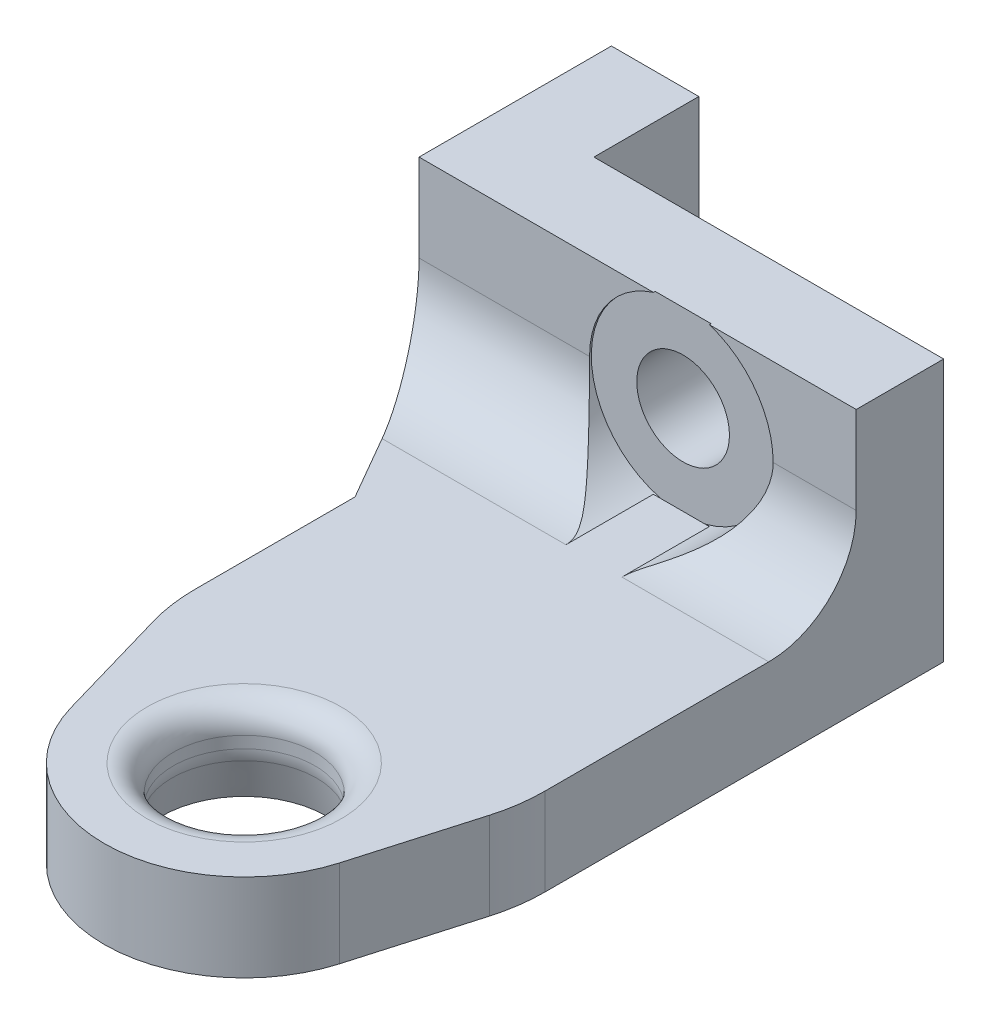
ISO-10303-21;
HEADER;
FILE_DESCRIPTION(('STEP AP214'),'2;1');
FILE_NAME('part.step','',(''),(''),'','','');
FILE_SCHEMA(('AUTOMOTIVE_DESIGN { 1 0 10303 214 1 1 1 1 }'));
ENDSEC;
DATA;
#1=APPLICATION_CONTEXT('core data for automotive mechanical design processes');
#2=APPLICATION_PROTOCOL_DEFINITION('international standard','automotive_design',2000,#1);
#3=PRODUCT_CONTEXT('',#1,'mechanical');
#4=PRODUCT('Part','Part','',(#3));
#5=PRODUCT_RELATED_PRODUCT_CATEGORY('part','',(#4));
#6=PRODUCT_DEFINITION_FORMATION('','',#4);
#7=PRODUCT_DEFINITION_CONTEXT('part definition',#1,'design');
#8=PRODUCT_DEFINITION('design','',#6,#7);
#9=PRODUCT_DEFINITION_SHAPE('','',#8);
#10=(LENGTH_UNIT() NAMED_UNIT(*) SI_UNIT(.MILLI.,.METRE.));
#11=(NAMED_UNIT(*) PLANE_ANGLE_UNIT() SI_UNIT($,.RADIAN.));
#12=(NAMED_UNIT(*) SI_UNIT($,.STERADIAN.) SOLID_ANGLE_UNIT());
#13=UNCERTAINTY_MEASURE_WITH_UNIT(LENGTH_MEASURE(1.E-05),#10,'distance_accuracy_value','');
#14=(GEOMETRIC_REPRESENTATION_CONTEXT(3) GLOBAL_UNCERTAINTY_ASSIGNED_CONTEXT((#13)) GLOBAL_UNIT_ASSIGNED_CONTEXT((#10,
#11,#12)) REPRESENTATION_CONTEXT('',''));
#15=CARTESIAN_POINT('',(0.,0.,0.));
#16=DIRECTION('',(0.,0.,1.));
#17=DIRECTION('',(1.,0.,0.));
#18=AXIS2_PLACEMENT_3D('',#15,#16,#17);
#19=CARTESIAN_POINT('',(10.,15.,-25.));
#20=DIRECTION('',(0.,0.,-1.));
#21=DIRECTION('',(-1.,0.,0.));
#22=AXIS2_PLACEMENT_3D('',#19,#20,#21);
#23=PLANE('',#22);
#24=DIRECTION('',(0.,-1.,0.));
#25=VECTOR('',#24,1.);
#26=CARTESIAN_POINT('',(-15.,15.,-25.));
#27=LINE('',#26,#25);
#28=CARTESIAN_POINT('',(-15.,15.,-25.));
#29=VERTEX_POINT('',#28);
#30=CARTESIAN_POINT('',(-15.,10.,-25.));
#31=VERTEX_POINT('',#30);
#32=EDGE_CURVE('E393',#29,#31,#27,.T.);
#33=ORIENTED_EDGE('',*,*,#32,.T.);
#34=DIRECTION('',(1.,0.,0.));
#35=VECTOR('',#34,1.);
#36=CARTESIAN_POINT('',(10.,10.,-25.));
#37=LINE('',#36,#35);
#38=CARTESIAN_POINT('',(-5.25,10.,-25.));
#39=VERTEX_POINT('',#38);
#40=EDGE_CURVE('E216',#31,#39,#37,.T.);
#41=ORIENTED_EDGE('',*,*,#40,.T.);
#42=CARTESIAN_POINT('',(0.,10.,-25.));
#43=DIRECTION('',(0.,0.,1.));
#44=DIRECTION('',(1.,0.,0.));
#45=AXIS2_PLACEMENT_3D('',#42,#43,#44);
#46=CIRCLE('',#45,5.25);
#47=CARTESIAN_POINT('',(-1.60078105935822,15.,-25.));
#48=VERTEX_POINT('',#47);
#49=EDGE_CURVE('E182',#48,#39,#46,.T.);
#50=ORIENTED_EDGE('',*,*,#49,.F.);
#51=DIRECTION('',(1.,0.,0.));
#52=VECTOR('',#51,1.);
#53=CARTESIAN_POINT('',(10.,15.,-25.));
#54=LINE('',#53,#52);
#55=EDGE_CURVE('E386',#29,#48,#54,.T.);
#56=ORIENTED_EDGE('',*,*,#55,.F.);
#57=EDGE_LOOP('',(#33,#41,#50,#56));
#58=FACE_BOUND('',#57,.T.);
#59=ADVANCED_FACE('F32',(#58),#23,.F.);
#60=CARTESIAN_POINT('',(5.25,10.,-25.));
#61=VERTEX_POINT('',#60);
#62=CARTESIAN_POINT('',(1.60078105935822,15.,-25.));
#63=VERTEX_POINT('',#62);
#64=EDGE_CURVE('E171',#61,#63,#46,.T.);
#65=ORIENTED_EDGE('',*,*,#64,.F.);
#66=DIRECTION('',(1.,0.,0.));
#67=VECTOR('',#66,1.);
#68=CARTESIAN_POINT('',(10.,10.,-25.));
#69=LINE('',#68,#67);
#70=CARTESIAN_POINT('',(10.,10.,-25.));
#71=VERTEX_POINT('',#70);
#72=EDGE_CURVE('E203',#61,#71,#69,.T.);
#73=ORIENTED_EDGE('',*,*,#72,.T.);
#74=DIRECTION('',(0.,-1.,0.));
#75=VECTOR('',#74,1.);
#76=CARTESIAN_POINT('',(10.,15.,-25.));
#77=LINE('',#76,#75);
#78=CARTESIAN_POINT('',(10.,15.,-25.));
#79=VERTEX_POINT('',#78);
#80=EDGE_CURVE('E388',#79,#71,#77,.T.);
#81=ORIENTED_EDGE('',*,*,#80,.F.);
#82=EDGE_CURVE('E385',#63,#79,#54,.T.);
#83=ORIENTED_EDGE('',*,*,#82,.F.);
#84=EDGE_LOOP('',(#65,#73,#81,#83));
#85=FACE_BOUND('',#84,.T.);
#86=ADVANCED_FACE('F259',(#85),#23,.F.);
#87=CARTESIAN_POINT('',(7.68461887368189,0.,2.22410268788388));
#88=DIRECTION('',(0.960577359210234,0.,0.278012835985485));
#89=DIRECTION('',(0.278012835985485,0.,-0.960577359210234));
#90=AXIS2_PLACEMENT_3D('',#87,#88,#89);
#91=PLANE('',#90);
#92=DIRECTION('',(0.278012835985485,0.,-0.960577359210234));
#93=VECTOR('',#92,1.);
#94=CARTESIAN_POINT('',(7.68461887368189,0.,2.22410268788388));
#95=LINE('',#94,#93);
#96=CARTESIAN_POINT('',(7.68461887368189,0.,2.22410268788387));
#97=VERTEX_POINT('',#96);
#98=CARTESIAN_POINT('',(9.60577359210235,0.,-4.41378408275055));
#99=VERTEX_POINT('',#98);
#100=EDGE_CURVE('E396',#97,#99,#95,.T.);
#101=ORIENTED_EDGE('',*,*,#100,.T.);
#102=DIRECTION('',(0.,1.,0.));
#103=VECTOR('',#102,1.);
#104=CARTESIAN_POINT('',(9.60577359210235,0.,-4.41378408275055));
#105=LINE('',#104,#103);
#106=CARTESIAN_POINT('',(9.60577359210235,5.,-4.41378408275055));
#107=VERTEX_POINT('',#106);
#108=EDGE_CURVE('E475',#99,#107,#105,.T.);
#109=ORIENTED_EDGE('',*,*,#108,.T.);
#110=DIRECTION('',(0.278012835985485,0.,-0.960577359210234));
#111=VECTOR('',#110,1.);
#112=CARTESIAN_POINT('',(7.68461887368189,5.,2.22410268788388));
#113=LINE('',#112,#111);
#114=CARTESIAN_POINT('',(7.68461887368189,5.,2.22410268788387));
#115=VERTEX_POINT('',#114);
#116=EDGE_CURVE('E395',#115,#107,#113,.T.);
#117=ORIENTED_EDGE('',*,*,#116,.F.);
#118=DIRECTION('',(0.,1.,0.));
#119=VECTOR('',#118,1.);
#120=CARTESIAN_POINT('',(7.68461887368189,0.,2.22410268788387));
#121=LINE('',#120,#119);
#122=EDGE_CURVE('E188',#97,#115,#121,.T.);
#123=ORIENTED_EDGE('',*,*,#122,.F.);
#124=EDGE_LOOP('',(#101,#109,#117,#123));
#125=FACE_BOUND('',#124,.T.);
#126=ADVANCED_FACE('F265',(#125),#91,.T.);
#127=CARTESIAN_POINT('',(0.,0.,0.));
#128=DIRECTION('',(0.,1.,0.));
#129=DIRECTION('',(0.,0.,1.));
#130=AXIS2_PLACEMENT_3D('',#127,#128,#129);
#131=CYLINDRICAL_SURFACE('',#130,8.00000000000001);
#132=CARTESIAN_POINT('',(0.,5.,0.));
#133=DIRECTION('',(0.,1.,0.));
#134=DIRECTION('',(0.,0.,1.));
#135=AXIS2_PLACEMENT_3D('',#132,#133,#134);
#136=CIRCLE('',#135,8.00000000000001);
#137=CARTESIAN_POINT('',(-7.68461887368188,5.,2.22410268788388));
#138=VERTEX_POINT('',#137);
#139=EDGE_CURVE('E400',#138,#115,#136,.T.);
#140=ORIENTED_EDGE('',*,*,#139,.F.);
#141=DIRECTION('',(0.,1.,0.));
#142=VECTOR('',#141,1.);
#143=CARTESIAN_POINT('',(-7.68461887368188,0.,2.22410268788388));
#144=LINE('',#143,#142);
#145=CARTESIAN_POINT('',(-7.68461887368188,0.,2.22410268788388));
#146=VERTEX_POINT('',#145);
#147=EDGE_CURVE('E431',#146,#138,#144,.T.);
#148=ORIENTED_EDGE('',*,*,#147,.F.);
#149=CARTESIAN_POINT('',(0.,0.,0.));
#150=DIRECTION('',(0.,1.,0.));
#151=DIRECTION('',(0.,0.,1.));
#152=AXIS2_PLACEMENT_3D('',#149,#150,#151);
#153=CIRCLE('',#152,8.00000000000001);
#154=EDGE_CURVE('E413',#146,#97,#153,.T.);
#155=ORIENTED_EDGE('',*,*,#154,.T.);
#156=ORIENTED_EDGE('',*,*,#122,.T.);
#157=EDGE_LOOP('',(#140,#148,#155,#156));
#158=FACE_BOUND('',#157,.T.);
#159=ADVANCED_FACE('F280',(#158),#131,.T.);
#160=CARTESIAN_POINT('',(-10.,0.,-5.77589731211611));
#161=DIRECTION('',(-0.960577359210234,0.,0.278012835985485));
#162=DIRECTION('',(0.278012835985486,0.,0.960577359210234));
#163=AXIS2_PLACEMENT_3D('',#160,#161,#162);
#164=PLANE('',#163);
#165=DIRECTION('',(0.278012835985486,0.,0.960577359210234));
#166=VECTOR('',#165,1.);
#167=CARTESIAN_POINT('',(-10.,5.,-5.77589731211611));
#168=LINE('',#167,#166);
#169=CARTESIAN_POINT('',(-9.60577359210235,5.,-4.41378408275054));
#170=VERTEX_POINT('',#169);
#171=EDGE_CURVE('E426',#170,#138,#168,.T.);
#172=ORIENTED_EDGE('',*,*,#171,.F.);
#173=DIRECTION('',(0.,1.,0.));
#174=VECTOR('',#173,1.);
#175=CARTESIAN_POINT('',(-9.60577359210235,0.,-4.41378408275055));
#176=LINE('',#175,#174);
#177=CARTESIAN_POINT('',(-9.60577359210235,0.,-4.41378408275054));
#178=VERTEX_POINT('',#177);
#179=EDGE_CURVE('E11',#170,#178,#176,.F.);
#180=ORIENTED_EDGE('',*,*,#179,.T.);
#181=DIRECTION('',(0.278012835985486,0.,0.960577359210234));
#182=VECTOR('',#181,1.);
#183=CARTESIAN_POINT('',(-10.,0.,-5.77589731211611));
#184=LINE('',#183,#182);
#185=EDGE_CURVE('E411',#178,#146,#184,.T.);
#186=ORIENTED_EDGE('',*,*,#185,.T.);
#187=ORIENTED_EDGE('',*,*,#147,.T.);
#188=EDGE_LOOP('',(#172,#180,#186,#187));
#189=FACE_BOUND('',#188,.T.);
#190=ADVANCED_FACE('F283',(#189),#164,.T.);
#191=CARTESIAN_POINT('',(-10.,0.,-16.3397459621555));
#192=DIRECTION('',(-1.,0.,0.));
#193=DIRECTION('',(0.,0.,1.));
#194=AXIS2_PLACEMENT_3D('',#191,#192,#193);
#195=PLANE('',#194);
#196=DIRECTION('',(0.,0.,1.));
#197=VECTOR('',#196,1.);
#198=CARTESIAN_POINT('',(-10.,0.,-16.3397459621555));
#199=LINE('',#198,#197);
#200=CARTESIAN_POINT('',(-10.,0.,-16.3397459621555));
#201=VERTEX_POINT('',#200);
#202=CARTESIAN_POINT('',(-10.,0.,-7.1939124426054));
#203=VERTEX_POINT('',#202);
#204=EDGE_CURVE('E409',#201,#203,#199,.T.);
#205=ORIENTED_EDGE('',*,*,#204,.T.);
#206=DIRECTION('',(0.,1.,0.));
#207=VECTOR('',#206,1.);
#208=CARTESIAN_POINT('',(-10.,0.,-7.1939124426054));
#209=LINE('',#208,#207);
#210=CARTESIAN_POINT('',(-10.,5.,-7.1939124426054));
#211=VERTEX_POINT('',#210);
#212=EDGE_CURVE('E40',#203,#211,#209,.T.);
#213=ORIENTED_EDGE('',*,*,#212,.T.);
#214=DIRECTION('',(0.,0.,1.));
#215=VECTOR('',#214,1.);
#216=CARTESIAN_POINT('',(-10.,5.,-16.3397459621555));
#217=LINE('',#216,#215);
#218=CARTESIAN_POINT('',(-10.,5.,-16.3397459621555));
#219=VERTEX_POINT('',#218);
#220=EDGE_CURVE('E423',#219,#211,#217,.T.);
#221=ORIENTED_EDGE('',*,*,#220,.F.);
#222=DIRECTION('',(0.,1.,0.));
#223=VECTOR('',#222,1.);
#224=CARTESIAN_POINT('',(-10.,0.,-16.3397459621555));
#225=LINE('',#224,#223);
#226=EDGE_CURVE('E434',#201,#219,#225,.T.);
#227=ORIENTED_EDGE('',*,*,#226,.F.);
#228=EDGE_LOOP('',(#205,#213,#221,#227));
#229=FACE_BOUND('',#228,.T.);
#230=ADVANCED_FACE('F287',(#229),#195,.T.);
#231=CARTESIAN_POINT('',(-15.,0.,-25.));
#232=DIRECTION('',(-0.866025403784441,0.,0.499999999999996));
#233=DIRECTION('',(0.499999999999996,0.,0.866025403784441));
#234=AXIS2_PLACEMENT_3D('',#231,#232,#233);
#235=PLANE('',#234);
#236=DIRECTION('',(0.499999999999996,0.,0.866025403784441));
#237=VECTOR('',#236,1.);
#238=CARTESIAN_POINT('',(-15.,5.,-25.));
#239=LINE('',#238,#237);
#240=CARTESIAN_POINT('',(-12.1132486540519,5.,-20.));
#241=VERTEX_POINT('',#240);
#242=EDGE_CURVE('E421',#241,#219,#239,.T.);
#243=ORIENTED_EDGE('',*,*,#242,.F.);
#244=CARTESIAN_POINT('',(-12.1132486540519,10.,-20.));
#245=DIRECTION('',(-0.866025403784441,0.,0.499999999999996));
#246=DIRECTION('',(0.499999999999996,0.,0.866025403784441));
#247=AXIS2_PLACEMENT_3D('',#244,#245,#246);
#248=ELLIPSE('',#247,5.77350269189624,5.);
#249=EDGE_CURVE('E485',#241,#31,#248,.F.);
#250=ORIENTED_EDGE('',*,*,#249,.T.);
#251=DIRECTION('',(0.,1.,0.));
#252=VECTOR('',#251,1.);
#253=CARTESIAN_POINT('',(-15.,0.,-25.));
#254=LINE('',#253,#252);
#255=CARTESIAN_POINT('',(-15.,0.,-25.));
#256=VERTEX_POINT('',#255);
#257=EDGE_CURVE('E437',#256,#31,#254,.T.);
#258=ORIENTED_EDGE('',*,*,#257,.F.);
#259=DIRECTION('',(0.499999999999996,0.,0.866025403784441));
#260=VECTOR('',#259,1.);
#261=CARTESIAN_POINT('',(-15.,0.,-25.));
#262=LINE('',#261,#260);
#263=EDGE_CURVE('E406',#256,#201,#262,.T.);
#264=ORIENTED_EDGE('',*,*,#263,.T.);
#265=ORIENTED_EDGE('',*,*,#226,.T.);
#266=EDGE_LOOP('',(#243,#250,#258,#264,#265));
#267=FACE_BOUND('',#266,.T.);
#268=ADVANCED_FACE('F290',(#267),#235,.T.);
#269=CARTESIAN_POINT('',(-15.,0.,-36.));
#270=DIRECTION('',(-1.,0.,0.));
#271=DIRECTION('',(0.,0.,1.));
#272=AXIS2_PLACEMENT_3D('',#269,#270,#271);
#273=PLANE('',#272);
#274=ORIENTED_EDGE('',*,*,#257,.T.);
#275=ORIENTED_EDGE('',*,*,#32,.F.);
#276=DIRECTION('',(0.,0.,1.));
#277=VECTOR('',#276,1.);
#278=CARTESIAN_POINT('',(-15.,15.,-25.));
#279=LINE('',#278,#277);
#280=CARTESIAN_POINT('',(-15.,15.,-36.));
#281=VERTEX_POINT('',#280);
#282=EDGE_CURVE('E383',#281,#29,#279,.T.);
#283=ORIENTED_EDGE('',*,*,#282,.F.);
#284=DIRECTION('',(0.,1.,0.));
#285=VECTOR('',#284,1.);
#286=CARTESIAN_POINT('',(-15.,0.,-36.));
#287=LINE('',#286,#285);
#288=CARTESIAN_POINT('',(-15.,0.,-36.));
#289=VERTEX_POINT('',#288);
#290=EDGE_CURVE('E416',#289,#281,#287,.T.);
#291=ORIENTED_EDGE('',*,*,#290,.F.);
#292=DIRECTION('',(0.,0.,1.));
#293=VECTOR('',#292,1.);
#294=CARTESIAN_POINT('',(-15.,0.,-36.));
#295=LINE('',#294,#293);
#296=EDGE_CURVE('E403',#289,#256,#295,.T.);
#297=ORIENTED_EDGE('',*,*,#296,.T.);
#298=EDGE_LOOP('',(#274,#275,#283,#291,#297));
#299=FACE_BOUND('',#298,.T.);
#300=ADVANCED_FACE('F294',(#299),#273,.T.);
#301=CARTESIAN_POINT('',(9.99999999999999,0.,-36.));
#302=DIRECTION('',(0.,0.,-1.));
#303=DIRECTION('',(-1.,0.,0.));
#304=AXIS2_PLACEMENT_3D('',#301,#302,#303);
#305=PLANE('',#304);
#306=DIRECTION('',(0.,-1.,0.));
#307=VECTOR('',#306,1.);
#308=CARTESIAN_POINT('',(-10.,15.,-36.));
#309=LINE('',#308,#307);
#310=CARTESIAN_POINT('',(-10.,15.,-36.));
#311=VERTEX_POINT('',#310);
#312=CARTESIAN_POINT('',(-10.,0.,-36.));
#313=VERTEX_POINT('',#312);
#314=EDGE_CURVE('E375',#311,#313,#309,.T.);
#315=ORIENTED_EDGE('',*,*,#314,.T.);
#316=DIRECTION('',(-1.,0.,0.));
#317=VECTOR('',#316,1.);
#318=CARTESIAN_POINT('',(9.99999999999999,0.,-36.));
#319=LINE('',#318,#317);
#320=EDGE_CURVE('E364',#313,#289,#319,.T.);
#321=ORIENTED_EDGE('',*,*,#320,.T.);
#322=ORIENTED_EDGE('',*,*,#290,.T.);
#323=DIRECTION('',(-1.,0.,0.));
#324=VECTOR('',#323,1.);
#325=CARTESIAN_POINT('',(-15.,15.,-36.));
#326=LINE('',#325,#324);
#327=EDGE_CURVE('E381',#311,#281,#326,.T.);
#328=ORIENTED_EDGE('',*,*,#327,.F.);
#329=EDGE_LOOP('',(#315,#321,#322,#328));
#330=FACE_BOUND('',#329,.T.);
#331=ADVANCED_FACE('F298',(#330),#305,.T.);
#332=CARTESIAN_POINT('',(10.,0.,-5.77589731211612));
#333=DIRECTION('',(1.,0.,0.));
#334=DIRECTION('',(0.,0.,-1.));
#335=AXIS2_PLACEMENT_3D('',#332,#333,#334);
#336=PLANE('',#335);
#337=DIRECTION('',(0.,0.,-1.));
#338=VECTOR('',#337,1.);
#339=CARTESIAN_POINT('',(10.,5.,-5.77589731211612));
#340=LINE('',#339,#338);
#341=CARTESIAN_POINT('',(10.,5.,-7.19391244260541));
#342=VERTEX_POINT('',#341);
#343=CARTESIAN_POINT('',(10.,5.,-20.));
#344=VERTEX_POINT('',#343);
#345=EDGE_CURVE('E419',#342,#344,#340,.T.);
#346=ORIENTED_EDGE('',*,*,#345,.F.);
#347=DIRECTION('',(0.,1.,0.));
#348=VECTOR('',#347,1.);
#349=CARTESIAN_POINT('',(10.,0.,-7.19391244260541));
#350=LINE('',#349,#348);
#351=CARTESIAN_POINT('',(10.,0.,-7.19391244260541));
#352=VERTEX_POINT('',#351);
#353=EDGE_CURVE('E470',#342,#352,#350,.F.);
#354=ORIENTED_EDGE('',*,*,#353,.T.);
#355=DIRECTION('',(0.,0.,-1.));
#356=VECTOR('',#355,1.);
#357=CARTESIAN_POINT('',(10.,0.,-5.77589731211612));
#358=LINE('',#357,#356);
#359=CARTESIAN_POINT('',(9.99999999999999,0.,-30.));
#360=VERTEX_POINT('',#359);
#361=EDGE_CURVE('E399',#352,#360,#358,.T.);
#362=ORIENTED_EDGE('',*,*,#361,.T.);
#363=DIRECTION('',(0.,-1.,0.));
#364=VECTOR('',#363,1.);
#365=CARTESIAN_POINT('',(9.99999999999999,15.,-30.));
#366=LINE('',#365,#364);
#367=CARTESIAN_POINT('',(9.99999999999999,15.,-30.));
#368=VERTEX_POINT('',#367);
#369=EDGE_CURVE('E357',#368,#360,#366,.T.);
#370=ORIENTED_EDGE('',*,*,#369,.F.);
#371=DIRECTION('',(0.,0.,-1.));
#372=VECTOR('',#371,1.);
#373=CARTESIAN_POINT('',(9.99999999999999,15.,-36.));
#374=LINE('',#373,#372);
#375=EDGE_CURVE('E378',#79,#368,#374,.T.);
#376=ORIENTED_EDGE('',*,*,#375,.F.);
#377=ORIENTED_EDGE('',*,*,#80,.T.);
#378=CARTESIAN_POINT('',(10.,10.,-20.));
#379=DIRECTION('',(1.,0.,0.));
#380=DIRECTION('',(0.,0.,-1.));
#381=AXIS2_PLACEMENT_3D('',#378,#379,#380);
#382=CIRCLE('',#381,5.);
#383=EDGE_CURVE('E219',#71,#344,#382,.F.);
#384=ORIENTED_EDGE('',*,*,#383,.T.);
#385=EDGE_LOOP('',(#346,#354,#362,#370,#376,#377,#384));
#386=FACE_BOUND('',#385,.T.);
#387=ADVANCED_FACE('F275',(#386),#336,.T.);
#388=CARTESIAN_POINT('',(0.,0.,0.));
#389=DIRECTION('',(0.,1.,0.));
#390=DIRECTION('',(0.,0.,1.));
#391=AXIS2_PLACEMENT_3D('',#388,#389,#390);
#392=PLANE('',#391);
#393=CARTESIAN_POINT('',(0.,0.,0.));
#394=DIRECTION('',(0.,-1.,0.));
#395=DIRECTION('',(0.,0.,-1.));
#396=AXIS2_PLACEMENT_3D('',#393,#394,#395);
#397=CIRCLE('',#396,4.71987298107022);
#398=CARTESIAN_POINT('',(0.,0.,-4.71987298107024));
#399=VERTEX_POINT('',#398);
#400=EDGE_CURVE('E360',#399,#399,#397,.T.);
#401=ORIENTED_EDGE('',*,*,#400,.F.);
#402=EDGE_LOOP('',(#401));
#403=FACE_BOUND('',#402,.T.);
#404=ORIENTED_EDGE('',*,*,#361,.F.);
#405=CARTESIAN_POINT('',(0.,0.,-7.1939124426054));
#406=DIRECTION('',(0.,1.,0.));
#407=DIRECTION('',(0.,0.,1.));
#408=AXIS2_PLACEMENT_3D('',#405,#406,#407);
#409=CIRCLE('',#408,10.);
#410=EDGE_CURVE('E472',#352,#99,#409,.F.);
#411=ORIENTED_EDGE('',*,*,#410,.T.);
#412=ORIENTED_EDGE('',*,*,#100,.F.);
#413=ORIENTED_EDGE('',*,*,#154,.F.);
#414=ORIENTED_EDGE('',*,*,#185,.F.);
#415=CARTESIAN_POINT('',(0.,0.,-7.1939124426054));
#416=DIRECTION('',(0.,1.,0.));
#417=DIRECTION('',(0.,0.,1.));
#418=AXIS2_PLACEMENT_3D('',#415,#416,#417);
#419=CIRCLE('',#418,10.);
#420=EDGE_CURVE('E47',#178,#203,#419,.F.);
#421=ORIENTED_EDGE('',*,*,#420,.T.);
#422=ORIENTED_EDGE('',*,*,#204,.F.);
#423=ORIENTED_EDGE('',*,*,#263,.F.);
#424=ORIENTED_EDGE('',*,*,#296,.F.);
#425=ORIENTED_EDGE('',*,*,#320,.F.);
#426=DIRECTION('',(0.,0.,-1.));
#427=VECTOR('',#426,1.);
#428=CARTESIAN_POINT('',(-10.,0.,-30.));
#429=LINE('',#428,#427);
#430=CARTESIAN_POINT('',(-10.,0.,-30.));
#431=VERTEX_POINT('',#430);
#432=EDGE_CURVE('E359',#431,#313,#429,.T.);
#433=ORIENTED_EDGE('',*,*,#432,.F.);
#434=DIRECTION('',(-1.,0.,0.));
#435=VECTOR('',#434,1.);
#436=CARTESIAN_POINT('',(9.99999999999999,0.,-30.));
#437=LINE('',#436,#435);
#438=EDGE_CURVE('E352',#360,#431,#437,.T.);
#439=ORIENTED_EDGE('',*,*,#438,.F.);
#440=EDGE_LOOP('',(#404,#411,#412,#413,#414,#421,#422,#423,#424,#425,#433,#439));
#441=FACE_BOUND('',#440,.T.);
#442=ADVANCED_FACE('F271',(#403,#441),#392,.F.);
#443=CARTESIAN_POINT('',(0.,5.,0.));
#444=DIRECTION('',(0.,1.,0.));
#445=DIRECTION('',(0.,0.,1.));
#446=AXIS2_PLACEMENT_3D('',#443,#444,#445);
#447=PLANE('',#446);
#448=CARTESIAN_POINT('',(0.,5.,0.));
#449=DIRECTION('',(0.,1.,0.));
#450=DIRECTION('',(0.,0.,1.));
#451=AXIS2_PLACEMENT_3D('',#448,#449,#450);
#452=CIRCLE('',#451,5.54999999999999);
#453=CARTESIAN_POINT('',(0.,5.,5.54999999999997));
#454=VERTEX_POINT('',#453);
#455=EDGE_CURVE('E194',#454,#454,#452,.F.);
#456=ORIENTED_EDGE('',*,*,#455,.T.);
#457=EDGE_LOOP('',(#456));
#458=FACE_BOUND('',#457,.T.);
#459=ORIENTED_EDGE('',*,*,#116,.T.);
#460=CARTESIAN_POINT('',(0.,5.,-7.1939124426054));
#461=DIRECTION('',(0.,1.,0.));
#462=DIRECTION('',(0.,0.,1.));
#463=AXIS2_PLACEMENT_3D('',#460,#461,#462);
#464=CIRCLE('',#463,10.);
#465=EDGE_CURVE('E481',#107,#342,#464,.T.);
#466=ORIENTED_EDGE('',*,*,#465,.T.);
#467=ORIENTED_EDGE('',*,*,#345,.T.);
#468=DIRECTION('',(1.,0.,0.));
#469=VECTOR('',#468,1.);
#470=CARTESIAN_POINT('',(0.,5.,-20.));
#471=LINE('',#470,#469);
#472=CARTESIAN_POINT('',(1.60078105935822,5.,-20.));
#473=VERTEX_POINT('',#472);
#474=EDGE_CURVE('E213',#344,#473,#471,.F.);
#475=ORIENTED_EDGE('',*,*,#474,.T.);
#476=DIRECTION('',(0.,0.,1.));
#477=VECTOR('',#476,1.);
#478=CARTESIAN_POINT('',(1.60078105935822,5.,-20.));
#479=LINE('',#478,#477);
#480=CARTESIAN_POINT('',(1.60078105935821,5.,-25.));
#481=VERTEX_POINT('',#480);
#482=EDGE_CURVE('E211',#473,#481,#479,.F.);
#483=ORIENTED_EDGE('',*,*,#482,.T.);
#484=DIRECTION('',(1.,0.,0.));
#485=VECTOR('',#484,1.);
#486=CARTESIAN_POINT('',(10.,5.,-25.));
#487=LINE('',#486,#485);
#488=CARTESIAN_POINT('',(-1.60078105935821,5.,-25.));
#489=VERTEX_POINT('',#488);
#490=EDGE_CURVE('E374',#489,#481,#487,.T.);
#491=ORIENTED_EDGE('',*,*,#490,.F.);
#492=DIRECTION('',(0.,0.,1.));
#493=VECTOR('',#492,1.);
#494=CARTESIAN_POINT('',(-1.60078105935821,5.,-25.));
#495=LINE('',#494,#493);
#496=CARTESIAN_POINT('',(-1.60078105935821,5.,-20.));
#497=VERTEX_POINT('',#496);
#498=EDGE_CURVE('E208',#489,#497,#495,.T.);
#499=ORIENTED_EDGE('',*,*,#498,.T.);
#500=DIRECTION('',(1.,0.,0.));
#501=VECTOR('',#500,1.);
#502=CARTESIAN_POINT('',(0.,5.,-20.));
#503=LINE('',#502,#501);
#504=EDGE_CURVE('E206',#497,#241,#503,.F.);
#505=ORIENTED_EDGE('',*,*,#504,.T.);
#506=ORIENTED_EDGE('',*,*,#242,.T.);
#507=ORIENTED_EDGE('',*,*,#220,.T.);
#508=CARTESIAN_POINT('',(0.,5.,-7.1939124426054));
#509=DIRECTION('',(0.,1.,0.));
#510=DIRECTION('',(0.,0.,1.));
#511=AXIS2_PLACEMENT_3D('',#508,#509,#510);
#512=CIRCLE('',#511,10.);
#513=EDGE_CURVE('E483',#211,#170,#512,.T.);
#514=ORIENTED_EDGE('',*,*,#513,.T.);
#515=ORIENTED_EDGE('',*,*,#171,.T.);
#516=ORIENTED_EDGE('',*,*,#139,.T.);
#517=EDGE_LOOP('',(#459,#466,#467,#475,#483,#491,#499,#505,#506,#507,#514,#515,#516));
#518=FACE_BOUND('',#517,.T.);
#519=ADVANCED_FACE('F274',(#458,#518),#447,.T.);
#520=CARTESIAN_POINT('',(0.,15.,0.));
#521=DIRECTION('',(0.,-1.,0.));
#522=DIRECTION('',(0.,0.,-1.));
#523=AXIS2_PLACEMENT_3D('',#520,#521,#522);
#524=PLANE('',#523);
#525=DIRECTION('',(1.,0.,0.));
#526=VECTOR('',#525,1.);
#527=CARTESIAN_POINT('',(0.,15.,-25.1));
#528=LINE('',#527,#526);
#529=CARTESIAN_POINT('',(-1.60078105935822,15.,-25.1));
#530=VERTEX_POINT('',#529);
#531=CARTESIAN_POINT('',(1.60078105935822,15.,-25.1));
#532=VERTEX_POINT('',#531);
#533=EDGE_CURVE('E176',#530,#532,#528,.T.);
#534=ORIENTED_EDGE('',*,*,#533,.T.);
#535=DIRECTION('',(0.,0.,1.));
#536=VECTOR('',#535,1.);
#537=CARTESIAN_POINT('',(1.60078105935822,15.,-25.));
#538=LINE('',#537,#536);
#539=EDGE_CURVE('E165',#532,#63,#538,.T.);
#540=ORIENTED_EDGE('',*,*,#539,.T.);
#541=ORIENTED_EDGE('',*,*,#82,.T.);
#542=ORIENTED_EDGE('',*,*,#375,.T.);
#543=DIRECTION('',(-1.,0.,0.));
#544=VECTOR('',#543,1.);
#545=CARTESIAN_POINT('',(9.99999999999999,15.,-30.));
#546=LINE('',#545,#544);
#547=CARTESIAN_POINT('',(-10.,15.,-30.));
#548=VERTEX_POINT('',#547);
#549=EDGE_CURVE('E366',#368,#548,#546,.T.);
#550=ORIENTED_EDGE('',*,*,#549,.T.);
#551=DIRECTION('',(0.,0.,-1.));
#552=VECTOR('',#551,1.);
#553=CARTESIAN_POINT('',(-10.,15.,-30.));
#554=LINE('',#553,#552);
#555=EDGE_CURVE('E369',#548,#311,#554,.T.);
#556=ORIENTED_EDGE('',*,*,#555,.T.);
#557=ORIENTED_EDGE('',*,*,#327,.T.);
#558=ORIENTED_EDGE('',*,*,#282,.T.);
#559=ORIENTED_EDGE('',*,*,#55,.T.);
#560=DIRECTION('',(0.,0.,1.));
#561=VECTOR('',#560,1.);
#562=CARTESIAN_POINT('',(-1.60078105935822,15.,-25.));
#563=LINE('',#562,#561);
#564=EDGE_CURVE('E186',#48,#530,#563,.F.);
#565=ORIENTED_EDGE('',*,*,#564,.T.);
#566=EDGE_LOOP('',(#534,#540,#541,#542,#550,#556,#557,#558,#559,#565));
#567=FACE_BOUND('',#566,.T.);
#568=ADVANCED_FACE('F184',(#567),#524,.F.);
#569=CARTESIAN_POINT('',(9.99999999999999,15.,-30.));
#570=DIRECTION('',(0.,0.,1.));
#571=DIRECTION('',(1.,0.,0.));
#572=AXIS2_PLACEMENT_3D('',#569,#570,#571);
#573=PLANE('',#572);
#574=CARTESIAN_POINT('',(0.,10.,-30.));
#575=DIRECTION('',(0.,0.,1.));
#576=DIRECTION('',(1.,0.,0.));
#577=AXIS2_PLACEMENT_3D('',#574,#575,#576);
#578=CIRCLE('',#577,2.65);
#579=CARTESIAN_POINT('',(2.65,10.,-30.));
#580=VERTEX_POINT('',#579);
#581=EDGE_CURVE('E348',#580,#580,#578,.T.);
#582=ORIENTED_EDGE('',*,*,#581,.T.);
#583=EDGE_LOOP('',(#582));
#584=FACE_BOUND('',#583,.T.);
#585=ORIENTED_EDGE('',*,*,#438,.T.);
#586=DIRECTION('',(0.,-1.,0.));
#587=VECTOR('',#586,1.);
#588=CARTESIAN_POINT('',(-10.,15.,-30.));
#589=LINE('',#588,#587);
#590=EDGE_CURVE('E354',#548,#431,#589,.T.);
#591=ORIENTED_EDGE('',*,*,#590,.F.);
#592=ORIENTED_EDGE('',*,*,#549,.F.);
#593=ORIENTED_EDGE('',*,*,#369,.T.);
#594=EDGE_LOOP('',(#585,#591,#592,#593));
#595=FACE_BOUND('',#594,.T.);
#596=ADVANCED_FACE('F336',(#584,#595),#573,.F.);
#597=CARTESIAN_POINT('',(-10.,15.,-30.));
#598=DIRECTION('',(-1.,0.,0.));
#599=DIRECTION('',(0.,0.,1.));
#600=AXIS2_PLACEMENT_3D('',#597,#598,#599);
#601=PLANE('',#600);
#602=ORIENTED_EDGE('',*,*,#432,.T.);
#603=ORIENTED_EDGE('',*,*,#314,.F.);
#604=ORIENTED_EDGE('',*,*,#555,.F.);
#605=ORIENTED_EDGE('',*,*,#590,.T.);
#606=EDGE_LOOP('',(#602,#603,#604,#605));
#607=FACE_BOUND('',#606,.T.);
#608=ADVANCED_FACE('F326',(#607),#601,.F.);
#609=CARTESIAN_POINT('',(0.,0.,0.));
#610=DIRECTION('',(0.,-1.,0.));
#611=DIRECTION('',(0.,0.,-1.));
#612=AXIS2_PLACEMENT_3D('',#609,#610,#611);
#613=CYLINDRICAL_SURFACE('',#612,4.04999999999999);
#614=CARTESIAN_POINT('',(0.,2.82913124398934,0.));
#615=DIRECTION('',(0.,1.,0.));
#616=DIRECTION('',(0.,0.,1.));
#617=AXIS2_PLACEMENT_3D('',#614,#615,#616);
#618=CIRCLE('',#617,4.04999999999999);
#619=CARTESIAN_POINT('',(0.,2.82913124398934,4.04999999999997));
#620=VERTEX_POINT('',#619);
#621=EDGE_CURVE('E197',#620,#620,#618,.F.);
#622=ORIENTED_EDGE('',*,*,#621,.T.);
#623=EDGE_LOOP('',(#622));
#624=FACE_BOUND('',#623,.T.);
#625=CARTESIAN_POINT('',(0.,3.5,0.));
#626=DIRECTION('',(0.,1.,0.));
#627=DIRECTION('',(0.,0.,1.));
#628=AXIS2_PLACEMENT_3D('',#625,#626,#627);
#629=CIRCLE('',#628,4.04999999999999);
#630=CARTESIAN_POINT('',(0.,3.5,4.04999999999997));
#631=VERTEX_POINT('',#630);
#632=EDGE_CURVE('E175',#631,#631,#629,.T.);
#633=ORIENTED_EDGE('',*,*,#632,.T.);
#634=EDGE_LOOP('',(#633));
#635=FACE_BOUND('',#634,.T.);
#636=ADVANCED_FACE('F323',(#624,#635),#613,.F.);
#637=CARTESIAN_POINT('',(0.,0.,0.));
#638=DIRECTION('',(0.,-1.,0.));
#639=DIRECTION('',(0.,0.,-1.));
#640=AXIS2_PLACEMENT_3D('',#637,#638,#639);
#641=CONICAL_SURFACE('',#640,4.71987298107022,0.261799387793521);
#642=CARTESIAN_POINT('',(0.,2.18208363124663,0.));
#643=DIRECTION('',(0.,1.,0.));
#644=DIRECTION('',(0.,0.,1.));
#645=AXIS2_PLACEMENT_3D('',#642,#643,#644);
#646=CIRCLE('',#645,4.13518543427367);
#647=CARTESIAN_POINT('',(0.,2.18208363124663,4.13518543427365));
#648=VERTEX_POINT('',#647);
#649=EDGE_CURVE('E200',#648,#648,#646,.T.);
#650=ORIENTED_EDGE('',*,*,#649,.T.);
#651=EDGE_LOOP('',(#650));
#652=FACE_BOUND('',#651,.T.);
#653=ORIENTED_EDGE('',*,*,#400,.T.);
#654=EDGE_LOOP('',(#653));
#655=FACE_BOUND('',#654,.T.);
#656=ADVANCED_FACE('F325',(#652,#655),#641,.F.);
#657=CARTESIAN_POINT('',(5.25,10.,-25.));
#658=DIRECTION('',(0.,0.,1.));
#659=DIRECTION('',(1.,0.,0.));
#660=AXIS2_PLACEMENT_3D('',#657,#658,#659);
#661=PLANE('',#660);
#662=ORIENTED_EDGE('',*,*,#490,.T.);
#663=EDGE_CURVE('E456',#489,#481,#46,.T.);
#664=ORIENTED_EDGE('',*,*,#663,.F.);
#665=EDGE_LOOP('',(#662,#664));
#666=FACE_BOUND('',#665,.T.);
#667=ADVANCED_FACE('F333',(#666),#661,.F.);
#668=CARTESIAN_POINT('',(2.65,10.,-25.1));
#669=DIRECTION('',(0.,0.,-1.));
#670=DIRECTION('',(-1.,0.,0.));
#671=AXIS2_PLACEMENT_3D('',#668,#669,#670);
#672=PLANE('',#671);
#673=CARTESIAN_POINT('',(0.,10.,-25.1));
#674=DIRECTION('',(0.,0.,1.));
#675=DIRECTION('',(1.,0.,0.));
#676=AXIS2_PLACEMENT_3D('',#673,#674,#675);
#677=CIRCLE('',#676,2.65);
#678=CARTESIAN_POINT('',(2.65,10.,-25.1));
#679=VERTEX_POINT('',#678);
#680=EDGE_CURVE('E181',#679,#679,#677,.T.);
#681=ORIENTED_EDGE('',*,*,#680,.F.);
#682=EDGE_LOOP('',(#681));
#683=FACE_BOUND('',#682,.T.);
#684=CARTESIAN_POINT('',(0.,10.,-25.1));
#685=DIRECTION('',(0.,0.,1.));
#686=DIRECTION('',(1.,0.,0.));
#687=AXIS2_PLACEMENT_3D('',#684,#685,#686);
#688=CIRCLE('',#687,5.25);
#689=EDGE_CURVE('E168',#530,#532,#688,.T.);
#690=ORIENTED_EDGE('',*,*,#689,.T.);
#691=ORIENTED_EDGE('',*,*,#533,.F.);
#692=EDGE_LOOP('',(#690,#691));
#693=FACE_BOUND('',#692,.T.);
#694=ADVANCED_FACE('F179',(#683,#693),#672,.F.);
#695=CARTESIAN_POINT('',(0.,10.,-25.));
#696=DIRECTION('',(0.,0.,1.));
#697=DIRECTION('',(1.,0.,0.));
#698=AXIS2_PLACEMENT_3D('',#695,#696,#697);
#699=CYLINDRICAL_SURFACE('',#698,5.25);
#700=ORIENTED_EDGE('',*,*,#689,.F.);
#701=ORIENTED_EDGE('',*,*,#564,.F.);
#702=ORIENTED_EDGE('',*,*,#49,.T.);
#703=CARTESIAN_POINT('',(-5.25,10.,-25.));
#704=CARTESIAN_POINT('',(-5.25002913548057,9.88578532650747,-25.0000287921523));
#705=CARTESIAN_POINT('',(-5.24627416317064,9.77158963126767,-24.9960878166356));
#706=CARTESIAN_POINT('',(-5.23141565332181,9.54429324119452,-24.9804839333823));
#707=CARTESIAN_POINT('',(-5.22031773715217,9.43119177582646,-24.9688269326233));
#708=CARTESIAN_POINT('',(-5.19111272125459,9.20788343994118,-24.9381344690349));
#709=CARTESIAN_POINT('',(-5.17306389757233,9.09766043081306,-24.9191603507967));
#710=CARTESIAN_POINT('',(-5.1303325006001,8.87995912474026,-24.874203593115));
#711=CARTESIAN_POINT('',(-5.10564900215093,8.77248121287075,-24.8482199762437));
#712=CARTESIAN_POINT('',(-5.05019833584154,8.56129206177093,-24.7897899404429));
#713=CARTESIAN_POINT('',(-5.01945003691678,8.45757029204321,-24.7573635641207));
#714=CARTESIAN_POINT('',(-4.95233880245973,8.25405209110193,-24.686500722128));
#715=CARTESIAN_POINT('',(-4.91597376857749,8.15425714446104,-24.6480620102471));
#716=CARTESIAN_POINT('',(-4.79916773242547,7.86113701575181,-24.5244054207071));
#717=CARTESIAN_POINT('',(-4.711074159628,7.67429242839103,-24.4309083956504));
#718=CARTESIAN_POINT('',(-4.47972823920883,7.24772655217325,-24.184257587253));
#719=CARTESIAN_POINT('',(-4.32860882998202,7.01737467271169,-24.0223012021892));
#720=CARTESIAN_POINT('',(-4.08606168079385,6.70084826506188,-23.759590361045));
#721=CARTESIAN_POINT('',(-4.00240713200687,6.60002171892378,-23.6685467897731));
#722=CARTESIAN_POINT('',(-3.83086354579123,6.40784909939617,-23.4805880886926));
#723=CARTESIAN_POINT('',(-3.74297484013263,6.3165022849796,-23.3836734187649));
#724=CARTESIAN_POINT('',(-3.53598952682381,6.11592170674216,-23.153414559238));
#725=CARTESIAN_POINT('',(-3.41574491856714,6.010054490359,-23.0181724433184));
#726=CARTESIAN_POINT('',(-3.17210483953129,5.81374617538494,-22.7394107728112));
#727=CARTESIAN_POINT('',(-3.04870717953314,5.72331614921343,-22.5958853748981));
#728=CARTESIAN_POINT('',(-2.80180169460119,5.55765030458921,-22.3008945917306));
#729=CARTESIAN_POINT('',(-2.67829435642838,5.48239056672736,-22.1494421878392));
#730=CARTESIAN_POINT('',(-2.43492239502765,5.34673080730471,-21.8374093370003));
#731=CARTESIAN_POINT('',(-2.31505365798515,5.28631341134201,-21.67683983632));
#732=CARTESIAN_POINT('',(-2.12054955710163,5.19650143201902,-21.393332639921));
#733=CARTESIAN_POINT('',(-2.04312751899381,5.16323662198327,-21.2735459879777));
#734=CARTESIAN_POINT('',(-1.89862360317866,5.10472359869407,-21.0258891020181));
#735=CARTESIAN_POINT('',(-1.83152887487539,5.07946538041658,-20.8980291979581));
#736=CARTESIAN_POINT('',(-1.73348737055636,5.04425287742753,-20.6705958351513));
#737=CARTESIAN_POINT('',(-1.69769793604592,5.0319852728654,-20.5735314362253));
#738=CARTESIAN_POINT('',(-1.6413289372341,5.01307127222896,-20.374678372645));
#739=CARTESIAN_POINT('',(-1.62067890537734,5.00639881195861,-20.2729139697187));
#740=CARTESIAN_POINT('',(-1.60680734220394,5.00193298162387,-20.1418995575618));
#741=CARTESIAN_POINT('',(-1.60455540155526,5.00120982523429,-20.1135986875262));
#742=CARTESIAN_POINT('',(-1.60154177574227,5.00024323566723,-20.0568685999227));
#743=CARTESIAN_POINT('',(-1.60078225229316,5.00000049835665,-20.028439255874));
#744=CARTESIAN_POINT('',(-1.60078105935822,5.,-20.));
#745=B_SPLINE_CURVE_WITH_KNOTS('',3,(#703,#704,#705,#706,#707,#708,#709,#710,#711,#712,#713,
#714,#715,#716,#717,#718,#719,#720,#721,#722,#723,#724,#725,#726,#727,#728,#729,#730,#731,#732,
#733,#734,#735,#736,#737,#738,#739,#740,#741,#742,#743,#744),.UNSPECIFIED.,.F.,.F.,(4,2,2,2,2,2,
2,2,2,2,2,2,2,2,2,2,2,2,2,2,4),(0.,0.342484437869252,0.684706990665105,1.02412072415927,
1.36358181111072,1.70200296126599,2.04055084899193,2.71833442087547,3.67156286492718,
4.14985877283676,4.62811726432796,5.25626528901796,5.88486198078499,6.51245965775784,
7.13931913205644,7.57823474470211,8.01659970702996,8.32823054919997,8.63840150848091,
8.72356567470994,8.808853107649),.UNSPECIFIED.);
#746=EDGE_CURVE('E230',#39,#497,#745,.T.);
#747=ORIENTED_EDGE('',*,*,#746,.T.);
#748=ORIENTED_EDGE('',*,*,#498,.F.);
#749=ORIENTED_EDGE('',*,*,#663,.T.);
#750=ORIENTED_EDGE('',*,*,#482,.F.);
#751=CARTESIAN_POINT('',(1.60078105935822,5.,-20.));
#752=CARTESIAN_POINT('',(1.60073694221863,4.99999294498138,-20.0513484229657));
#753=CARTESIAN_POINT('',(1.60325302447547,5.00079121086558,-20.1026494475243));
#754=CARTESIAN_POINT('',(1.61302038832274,5.00393064183028,-20.204620568934));
#755=CARTESIAN_POINT('',(1.62025923569354,5.00626775554061,-20.2552919674825));
#756=CARTESIAN_POINT('',(1.64814196837478,5.01537379754845,-20.4040222951601));
#757=CARTESIAN_POINT('',(1.67498271294328,5.02424330763794,-20.5008093808344));
#758=CARTESIAN_POINT('',(1.73452073714977,5.04472783194435,-20.6717777015032));
#759=CARTESIAN_POINT('',(1.76519836689505,5.0555246642956,-20.7468136959435));
#760=CARTESIAN_POINT('',(1.83226503393743,5.07998056420065,-20.8938394912269));
#761=CARTESIAN_POINT('',(1.86865821116133,5.09364170887593,-20.9658270356306));
#762=CARTESIAN_POINT('',(1.98462657541259,5.13886683139434,-21.1793166492369));
#763=CARTESIAN_POINT('',(2.07029696504594,5.17445071851293,-21.3166112416892));
#764=CARTESIAN_POINT('',(2.2643595441329,5.26202193916459,-21.605630464649));
#765=CARTESIAN_POINT('',(2.37413888273924,5.31576927069901,-21.7558419867201));
#766=CARTESIAN_POINT('',(2.59778722968,5.43599031014841,-22.0481097821093));
#767=CARTESIAN_POINT('',(2.71166037694107,5.50247720976089,-22.190157401834));
#768=CARTESIAN_POINT('',(2.93959350178963,5.64804090622682,-22.4667375544528));
#769=CARTESIAN_POINT('',(3.05365217028797,5.72708363913072,-22.6012891269076));
#770=CARTESIAN_POINT('',(3.27985551942517,5.89815186625409,-22.8634450555564));
#771=CARTESIAN_POINT('',(3.39200122153463,5.99017017207244,-22.9910532044876));
#772=CARTESIAN_POINT('',(3.59576766082452,6.17263694195429,-23.2201458151366));
#773=CARTESIAN_POINT('',(3.68791895628505,6.2612014932399,-23.3226544784611));
#774=CARTESIAN_POINT('',(3.86835980653122,6.44821202384404,-23.521857829884));
#775=CARTESIAN_POINT('',(3.95664893598884,6.54665908757842,-23.6185518780746));
#776=CARTESIAN_POINT('',(4.21381361797054,6.85702174968211,-23.8986195172176));
#777=CARTESIAN_POINT('',(4.3753740839714,7.08429533894788,-24.0724095211068));
#778=CARTESIAN_POINT('',(4.63116541757554,7.5177958970345,-24.3459024062564));
#779=CARTESIAN_POINT('',(4.73214200736414,7.71515520898503,-24.4532755128361));
#780=CARTESIAN_POINT('',(4.86638287434329,8.02677866031704,-24.5955879874643));
#781=CARTESIAN_POINT('',(4.90823101233724,8.1331539748107,-24.6398713816979));
#782=CARTESIAN_POINT('',(4.98554814560027,8.35072117142695,-24.7215850234756));
#783=CARTESIAN_POINT('',(5.02102002115573,8.46191085049521,-24.7590183654649));
#784=CARTESIAN_POINT('',(5.08459803146006,8.68739007979478,-24.8260489913315));
#785=CARTESIAN_POINT('',(5.11277407214782,8.80163767559813,-24.8557206749444));
#786=CARTESIAN_POINT('',(5.16162243589755,9.03346593066165,-24.9071284790986));
#787=CARTESIAN_POINT('',(5.18229618937241,9.15104594993615,-24.928866112379));
#788=CARTESIAN_POINT('',(5.2158243936589,9.38981416294136,-24.9641067319785));
#789=CARTESIAN_POINT('',(5.22859570042763,9.51102710576028,-24.9775221614952));
#790=CARTESIAN_POINT('',(5.24570691133296,9.75481689436272,-24.9954921867326));
#791=CARTESIAN_POINT('',(5.25003834355926,9.87739498651306,-25.0000378790551));
#792=CARTESIAN_POINT('',(5.25,10.,-25.));
#793=B_SPLINE_CURVE_WITH_KNOTS('',3,(#751,#752,#753,#754,#755,#756,#757,#758,#759,#760,#761,
#762,#763,#764,#765,#766,#767,#768,#769,#770,#771,#772,#773,#774,#775,#776,#777,#778,#779,#780,
#781,#782,#783,#784,#785,#786,#787,#788,#789,#790,#791,#792),.UNSPECIFIED.,.F.,.F.,(4,2,2,2,2,2,
2,2,2,2,2,2,2,2,2,2,2,2,2,2,4),(0.,0.153896300824353,0.307389045709174,0.608434839472698,
0.853452827616401,1.0986491145193,1.59463006402169,2.1749031812413,2.75578044487093,
3.33510789048888,3.91411564344271,4.40519017560994,4.89631865279739,5.87658498476168,
6.61258340967602,6.97996141592459,7.34717305078313,7.71072383715684,8.07420527117405,
8.44144872199855,8.80906062072185),.UNSPECIFIED.);
#794=EDGE_CURVE('E222',#473,#61,#793,.T.);
#795=ORIENTED_EDGE('',*,*,#794,.T.);
#796=ORIENTED_EDGE('',*,*,#64,.T.);
#797=ORIENTED_EDGE('',*,*,#539,.F.);
#798=EDGE_LOOP('',(#700,#701,#702,#747,#748,#749,#750,#795,#796,#797));
#799=FACE_BOUND('',#798,.T.);
#800=ADVANCED_FACE('F167',(#799),#699,.F.);
#801=CARTESIAN_POINT('',(0.,10.,-25.));
#802=DIRECTION('',(0.,0.,1.));
#803=DIRECTION('',(1.,0.,0.));
#804=AXIS2_PLACEMENT_3D('',#801,#802,#803);
#805=CYLINDRICAL_SURFACE('',#804,2.65);
#806=ORIENTED_EDGE('',*,*,#680,.T.);
#807=EDGE_LOOP('',(#806));
#808=FACE_BOUND('',#807,.T.);
#809=ORIENTED_EDGE('',*,*,#581,.F.);
#810=EDGE_LOOP('',(#809));
#811=FACE_BOUND('',#810,.T.);
#812=ADVANCED_FACE('F310',(#808,#811),#805,.F.);
#813=CARTESIAN_POINT('',(0.,3.5,0.));
#814=DIRECTION('',(0.,1.,0.));
#815=DIRECTION('',(0.,0.,1.));
#816=AXIS2_PLACEMENT_3D('',#813,#814,#815);
#817=TOROIDAL_SURFACE('',#816,5.54999999999999,1.5);
#818=ORIENTED_EDGE('',*,*,#455,.F.);
#819=EDGE_LOOP('',(#818));
#820=FACE_BOUND('',#819,.T.);
#821=ORIENTED_EDGE('',*,*,#632,.F.);
#822=EDGE_LOOP('',(#821));
#823=FACE_BOUND('',#822,.T.);
#824=ADVANCED_FACE('F308',(#820,#823),#817,.T.);
#825=CARTESIAN_POINT('',(0.,2.82913124398934,0.));
#826=DIRECTION('',(0.,1.,0.));
#827=DIRECTION('',(0.,0.,1.));
#828=AXIS2_PLACEMENT_3D('',#825,#826,#827);
#829=TOROIDAL_SURFACE('',#828,6.54999999999999,2.5);
#830=ORIENTED_EDGE('',*,*,#649,.F.);
#831=EDGE_LOOP('',(#830));
#832=FACE_BOUND('',#831,.T.);
#833=ORIENTED_EDGE('',*,*,#621,.F.);
#834=EDGE_LOOP('',(#833));
#835=FACE_BOUND('',#834,.T.);
#836=ADVANCED_FACE('F244',(#832,#835),#829,.T.);
#837=CARTESIAN_POINT('',(10.,10.,-20.));
#838=DIRECTION('',(1.,0.,0.));
#839=DIRECTION('',(0.,0.,-1.));
#840=AXIS2_PLACEMENT_3D('',#837,#838,#839);
#841=CYLINDRICAL_SURFACE('',#840,5.);
#842=ORIENTED_EDGE('',*,*,#794,.F.);
#843=ORIENTED_EDGE('',*,*,#474,.F.);
#844=ORIENTED_EDGE('',*,*,#383,.F.);
#845=ORIENTED_EDGE('',*,*,#72,.F.);
#846=EDGE_LOOP('',(#842,#843,#844,#845));
#847=FACE_BOUND('',#846,.T.);
#848=ADVANCED_FACE('F239',(#847),#841,.F.);
#849=CARTESIAN_POINT('',(10.,10.,-20.));
#850=DIRECTION('',(1.,0.,0.));
#851=DIRECTION('',(0.,0.,-1.));
#852=AXIS2_PLACEMENT_3D('',#849,#850,#851);
#853=CYLINDRICAL_SURFACE('',#852,5.);
#854=ORIENTED_EDGE('',*,*,#249,.F.);
#855=ORIENTED_EDGE('',*,*,#504,.F.);
#856=ORIENTED_EDGE('',*,*,#746,.F.);
#857=ORIENTED_EDGE('',*,*,#40,.F.);
#858=EDGE_LOOP('',(#854,#855,#856,#857));
#859=FACE_BOUND('',#858,.T.);
#860=ADVANCED_FACE('F243',(#859),#853,.F.);
#861=CARTESIAN_POINT('',(0.,0.,-7.1939124426054));
#862=DIRECTION('',(0.,1.,0.));
#863=DIRECTION('',(0.,0.,1.));
#864=AXIS2_PLACEMENT_3D('',#861,#862,#863);
#865=CYLINDRICAL_SURFACE('',#864,10.);
#866=ORIENTED_EDGE('',*,*,#410,.F.);
#867=ORIENTED_EDGE('',*,*,#353,.F.);
#868=ORIENTED_EDGE('',*,*,#465,.F.);
#869=ORIENTED_EDGE('',*,*,#108,.F.);
#870=EDGE_LOOP('',(#866,#867,#868,#869));
#871=FACE_BOUND('',#870,.T.);
#872=ADVANCED_FACE('F249',(#871),#865,.T.);
#873=CARTESIAN_POINT('',(0.,0.,-7.1939124426054));
#874=DIRECTION('',(0.,1.,0.));
#875=DIRECTION('',(0.,0.,1.));
#876=AXIS2_PLACEMENT_3D('',#873,#874,#875);
#877=CYLINDRICAL_SURFACE('',#876,10.);
#878=ORIENTED_EDGE('',*,*,#420,.F.);
#879=ORIENTED_EDGE('',*,*,#179,.F.);
#880=ORIENTED_EDGE('',*,*,#513,.F.);
#881=ORIENTED_EDGE('',*,*,#212,.F.);
#882=EDGE_LOOP('',(#878,#879,#880,#881));
#883=FACE_BOUND('',#882,.T.);
#884=ADVANCED_FACE('F34',(#883),#877,.T.);
#885=CLOSED_SHELL('',(#59,#86,#126,#159,#190,#230,#268,#300,#331,#387,#442,#519,#568,#596,#608,
#636,#656,#667,#694,#800,#812,#824,#836,#848,#860,#872,#884));
#886=MANIFOLD_SOLID_BREP('B2',#885);
#887=ADVANCED_BREP_SHAPE_REPRESENTATION('',(#18,#886),#14);
#888=SHAPE_DEFINITION_REPRESENTATION(#9,#887);
ENDSEC;
END-ISO-10303-21;
